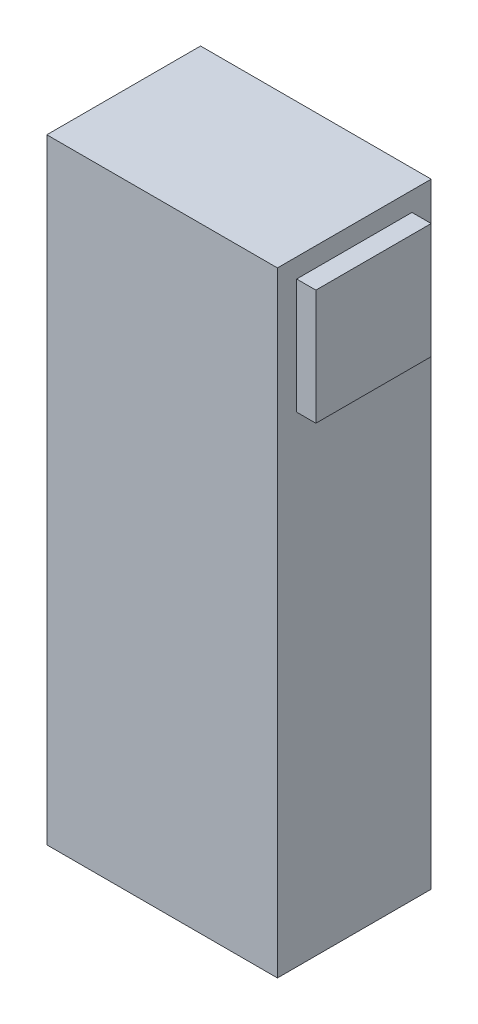
ISO-10303-21;
HEADER;
FILE_DESCRIPTION(('STEP AP214'),'2;1');
FILE_NAME('part.step','',(''),(''),'','','');
FILE_SCHEMA(('AUTOMOTIVE_DESIGN { 1 0 10303 214 1 1 1 1 }'));
ENDSEC;
DATA;
#1=APPLICATION_CONTEXT('core data for automotive mechanical design processes');
#2=APPLICATION_PROTOCOL_DEFINITION('international standard','automotive_design',2000,#1);
#3=PRODUCT_CONTEXT('',#1,'mechanical');
#4=PRODUCT('Part','Part','',(#3));
#5=PRODUCT_RELATED_PRODUCT_CATEGORY('part','',(#4));
#6=PRODUCT_DEFINITION_FORMATION('','',#4);
#7=PRODUCT_DEFINITION_CONTEXT('part definition',#1,'design');
#8=PRODUCT_DEFINITION('design','',#6,#7);
#9=PRODUCT_DEFINITION_SHAPE('','',#8);
#10=(LENGTH_UNIT() NAMED_UNIT(*) SI_UNIT(.MILLI.,.METRE.));
#11=(NAMED_UNIT(*) PLANE_ANGLE_UNIT() SI_UNIT($,.RADIAN.));
#12=(NAMED_UNIT(*) SI_UNIT($,.STERADIAN.) SOLID_ANGLE_UNIT());
#13=UNCERTAINTY_MEASURE_WITH_UNIT(LENGTH_MEASURE(1.E-05),#10,'distance_accuracy_value','');
#14=(GEOMETRIC_REPRESENTATION_CONTEXT(3) GLOBAL_UNCERTAINTY_ASSIGNED_CONTEXT((#13)) GLOBAL_UNIT_ASSIGNED_CONTEXT((#10,
#11,#12)) REPRESENTATION_CONTEXT('',''));
#15=CARTESIAN_POINT('',(0.,0.,0.));
#16=DIRECTION('',(0.,0.,1.));
#17=DIRECTION('',(1.,0.,0.));
#18=AXIS2_PLACEMENT_3D('',#15,#16,#17);
#19=CARTESIAN_POINT('',(0.,101.6,0.));
#20=DIRECTION('',(1.,0.,0.));
#21=DIRECTION('',(0.,0.,-1.));
#22=AXIS2_PLACEMENT_3D('',#19,#20,#21);
#23=PLANE('',#22);
#24=DIRECTION('',(0.,0.,1.));
#25=VECTOR('',#24,1.);
#26=CARTESIAN_POINT('',(0.,0.,0.));
#27=LINE('',#26,#25);
#28=CARTESIAN_POINT('',(0.,0.,-25.4));
#29=VERTEX_POINT('',#28);
#30=CARTESIAN_POINT('',(0.,0.,0.));
#31=VERTEX_POINT('',#30);
#32=EDGE_CURVE('E115',#29,#31,#27,.T.);
#33=ORIENTED_EDGE('',*,*,#32,.T.);
#34=DIRECTION('',(0.,-1.,0.));
#35=VECTOR('',#34,1.);
#36=CARTESIAN_POINT('',(0.,101.6,0.));
#37=LINE('',#36,#35);
#38=CARTESIAN_POINT('',(0.,101.6,0.));
#39=VERTEX_POINT('',#38);
#40=EDGE_CURVE('E11',#39,#31,#37,.T.);
#41=ORIENTED_EDGE('',*,*,#40,.F.);
#42=DIRECTION('',(0.,0.,1.));
#43=VECTOR('',#42,1.);
#44=CARTESIAN_POINT('',(0.,101.6,0.));
#45=LINE('',#44,#43);
#46=CARTESIAN_POINT('',(0.,101.6,-25.4));
#47=VERTEX_POINT('',#46);
#48=EDGE_CURVE('E145',#47,#39,#45,.T.);
#49=ORIENTED_EDGE('',*,*,#48,.F.);
#50=DIRECTION('',(0.,-1.,0.));
#51=VECTOR('',#50,1.);
#52=CARTESIAN_POINT('',(0.,101.6,-25.4));
#53=LINE('',#52,#51);
#54=EDGE_CURVE('E155',#47,#29,#53,.T.);
#55=ORIENTED_EDGE('',*,*,#54,.T.);
#56=EDGE_LOOP('',(#33,#41,#49,#55));
#57=FACE_BOUND('',#56,.T.);
#58=ADVANCED_FACE('F44',(#57),#23,.F.);
#59=CARTESIAN_POINT('',(0.,101.6,0.));
#60=DIRECTION('',(0.,0.,-1.));
#61=DIRECTION('',(-1.,0.,0.));
#62=AXIS2_PLACEMENT_3D('',#59,#60,#61);
#63=PLANE('',#62);
#64=DIRECTION('',(1.,0.,0.));
#65=VECTOR('',#64,1.);
#66=CARTESIAN_POINT('',(0.,0.,0.));
#67=LINE('',#66,#65);
#68=CARTESIAN_POINT('',(38.1,0.,0.));
#69=VERTEX_POINT('',#68);
#70=EDGE_CURVE('E158',#31,#69,#67,.T.);
#71=ORIENTED_EDGE('',*,*,#70,.T.);
#72=DIRECTION('',(0.,-1.,0.));
#73=VECTOR('',#72,1.);
#74=CARTESIAN_POINT('',(38.1,101.6,0.));
#75=LINE('',#74,#73);
#76=CARTESIAN_POINT('',(38.1,101.6,0.));
#77=VERTEX_POINT('',#76);
#78=EDGE_CURVE('E51',#77,#69,#75,.T.);
#79=ORIENTED_EDGE('',*,*,#78,.F.);
#80=DIRECTION('',(1.,0.,0.));
#81=VECTOR('',#80,1.);
#82=CARTESIAN_POINT('',(0.,101.6,0.));
#83=LINE('',#82,#81);
#84=EDGE_CURVE('E148',#39,#77,#83,.T.);
#85=ORIENTED_EDGE('',*,*,#84,.F.);
#86=ORIENTED_EDGE('',*,*,#40,.T.);
#87=EDGE_LOOP('',(#71,#79,#85,#86));
#88=FACE_BOUND('',#87,.T.);
#89=ADVANCED_FACE('F188',(#88),#63,.F.);
#90=CARTESIAN_POINT('',(38.1,101.6,0.));
#91=DIRECTION('',(-1.,0.,0.));
#92=DIRECTION('',(0.,0.,1.));
#93=AXIS2_PLACEMENT_3D('',#90,#91,#92);
#94=PLANE('',#93);
#95=DIRECTION('',(0.,0.,-1.));
#96=VECTOR('',#95,1.);
#97=CARTESIAN_POINT('',(38.1,98.425,0.));
#98=LINE('',#97,#96);
#99=CARTESIAN_POINT('',(38.1,98.425,-3.175));
#100=VERTEX_POINT('',#99);
#101=CARTESIAN_POINT('',(38.1,98.425,-22.225));
#102=VERTEX_POINT('',#101);
#103=EDGE_CURVE('E58',#100,#102,#98,.T.);
#104=ORIENTED_EDGE('',*,*,#103,.T.);
#105=DIRECTION('',(0.,-1.,0.));
#106=VECTOR('',#105,1.);
#107=CARTESIAN_POINT('',(38.1,0.,-22.225));
#108=LINE('',#107,#106);
#109=CARTESIAN_POINT('',(38.1,79.375,-22.225));
#110=VERTEX_POINT('',#109);
#111=EDGE_CURVE('E112',#102,#110,#108,.T.);
#112=ORIENTED_EDGE('',*,*,#111,.T.);
#113=DIRECTION('',(0.,0.,-1.));
#114=VECTOR('',#113,1.);
#115=CARTESIAN_POINT('',(38.1,79.375,0.));
#116=LINE('',#115,#114);
#117=CARTESIAN_POINT('',(38.1,79.375,-3.175));
#118=VERTEX_POINT('',#117);
#119=EDGE_CURVE('E125',#118,#110,#116,.T.);
#120=ORIENTED_EDGE('',*,*,#119,.F.);
#121=DIRECTION('',(0.,-1.,0.));
#122=VECTOR('',#121,1.);
#123=CARTESIAN_POINT('',(38.1,0.,-3.175));
#124=LINE('',#123,#122);
#125=EDGE_CURVE('E63',#100,#118,#124,.T.);
#126=ORIENTED_EDGE('',*,*,#125,.F.);
#127=EDGE_LOOP('',(#104,#112,#120,#126));
#128=FACE_BOUND('',#127,.T.);
#129=DIRECTION('',(0.,0.,-1.));
#130=VECTOR('',#129,1.);
#131=CARTESIAN_POINT('',(38.1,0.,0.));
#132=LINE('',#131,#130);
#133=CARTESIAN_POINT('',(38.1,0.,-25.4));
#134=VERTEX_POINT('',#133);
#135=EDGE_CURVE('E160',#69,#134,#132,.T.);
#136=ORIENTED_EDGE('',*,*,#135,.T.);
#137=DIRECTION('',(0.,-1.,0.));
#138=VECTOR('',#137,1.);
#139=CARTESIAN_POINT('',(38.1,101.6,-25.4));
#140=LINE('',#139,#138);
#141=CARTESIAN_POINT('',(38.1,101.6,-25.4));
#142=VERTEX_POINT('',#141);
#143=EDGE_CURVE('E165',#142,#134,#140,.T.);
#144=ORIENTED_EDGE('',*,*,#143,.F.);
#145=DIRECTION('',(0.,0.,-1.));
#146=VECTOR('',#145,1.);
#147=CARTESIAN_POINT('',(38.1,101.6,0.));
#148=LINE('',#147,#146);
#149=EDGE_CURVE('E151',#77,#142,#148,.T.);
#150=ORIENTED_EDGE('',*,*,#149,.F.);
#151=ORIENTED_EDGE('',*,*,#78,.T.);
#152=EDGE_LOOP('',(#136,#144,#150,#151));
#153=FACE_BOUND('',#152,.T.);
#154=ADVANCED_FACE('F172',(#128,#153),#94,.F.);
#155=CARTESIAN_POINT('',(0.,101.6,-25.4));
#156=DIRECTION('',(0.,0.,1.));
#157=DIRECTION('',(1.,0.,0.));
#158=AXIS2_PLACEMENT_3D('',#155,#156,#157);
#159=PLANE('',#158);
#160=DIRECTION('',(-1.,0.,0.));
#161=VECTOR('',#160,1.);
#162=CARTESIAN_POINT('',(0.,0.,-25.4));
#163=LINE('',#162,#161);
#164=EDGE_CURVE('E149',#134,#29,#163,.T.);
#165=ORIENTED_EDGE('',*,*,#164,.T.);
#166=ORIENTED_EDGE('',*,*,#54,.F.);
#167=DIRECTION('',(-1.,0.,0.));
#168=VECTOR('',#167,1.);
#169=CARTESIAN_POINT('',(0.,101.6,-25.4));
#170=LINE('',#169,#168);
#171=EDGE_CURVE('E153',#142,#47,#170,.T.);
#172=ORIENTED_EDGE('',*,*,#171,.F.);
#173=ORIENTED_EDGE('',*,*,#143,.T.);
#174=EDGE_LOOP('',(#165,#166,#172,#173));
#175=FACE_BOUND('',#174,.T.);
#176=ADVANCED_FACE('F181',(#175),#159,.F.);
#177=CARTESIAN_POINT('',(0.,101.6,0.));
#178=DIRECTION('',(0.,-1.,0.));
#179=DIRECTION('',(0.,0.,-1.));
#180=AXIS2_PLACEMENT_3D('',#177,#178,#179);
#181=PLANE('',#180);
#182=ORIENTED_EDGE('',*,*,#48,.T.);
#183=ORIENTED_EDGE('',*,*,#84,.T.);
#184=ORIENTED_EDGE('',*,*,#149,.T.);
#185=ORIENTED_EDGE('',*,*,#171,.T.);
#186=EDGE_LOOP('',(#182,#183,#184,#185));
#187=FACE_BOUND('',#186,.T.);
#188=ADVANCED_FACE('F187',(#187),#181,.F.);
#189=CARTESIAN_POINT('',(0.,0.,0.));
#190=DIRECTION('',(0.,-1.,0.));
#191=DIRECTION('',(0.,0.,-1.));
#192=AXIS2_PLACEMENT_3D('',#189,#190,#191);
#193=PLANE('',#192);
#194=ORIENTED_EDGE('',*,*,#32,.F.);
#195=ORIENTED_EDGE('',*,*,#164,.F.);
#196=ORIENTED_EDGE('',*,*,#135,.F.);
#197=ORIENTED_EDGE('',*,*,#70,.F.);
#198=EDGE_LOOP('',(#194,#195,#196,#197));
#199=FACE_BOUND('',#198,.T.);
#200=ADVANCED_FACE('F178',(#199),#193,.T.);
#201=CARTESIAN_POINT('',(41.275,0.,-22.225));
#202=DIRECTION('',(0.,0.,-1.));
#203=DIRECTION('',(0.,1.,0.));
#204=AXIS2_PLACEMENT_3D('',#201,#202,#203);
#205=PLANE('',#204);
#206=ORIENTED_EDGE('',*,*,#111,.F.);
#207=DIRECTION('',(-1.,0.,0.));
#208=VECTOR('',#207,1.);
#209=CARTESIAN_POINT('',(41.275,98.425,-22.225));
#210=LINE('',#209,#208);
#211=CARTESIAN_POINT('',(41.275,98.425,-22.225));
#212=VERTEX_POINT('',#211);
#213=EDGE_CURVE('E107',#212,#102,#210,.T.);
#214=ORIENTED_EDGE('',*,*,#213,.F.);
#215=DIRECTION('',(0.,-1.,0.));
#216=VECTOR('',#215,1.);
#217=CARTESIAN_POINT('',(41.275,0.,-22.225));
#218=LINE('',#217,#216);
#219=CARTESIAN_POINT('',(41.275,79.375,-22.225));
#220=VERTEX_POINT('',#219);
#221=EDGE_CURVE('E111',#212,#220,#218,.T.);
#222=ORIENTED_EDGE('',*,*,#221,.T.);
#223=DIRECTION('',(-1.,0.,0.));
#224=VECTOR('',#223,1.);
#225=CARTESIAN_POINT('',(41.275,79.375,-22.225));
#226=LINE('',#225,#224);
#227=EDGE_CURVE('E134',#220,#110,#226,.T.);
#228=ORIENTED_EDGE('',*,*,#227,.T.);
#229=EDGE_LOOP('',(#206,#214,#222,#228));
#230=FACE_BOUND('',#229,.T.);
#231=ADVANCED_FACE('F109',(#230),#205,.T.);
#232=CARTESIAN_POINT('',(41.275,98.425,0.));
#233=DIRECTION('',(0.,1.,0.));
#234=DIRECTION('',(0.,0.,1.));
#235=AXIS2_PLACEMENT_3D('',#232,#233,#234);
#236=PLANE('',#235);
#237=ORIENTED_EDGE('',*,*,#103,.F.);
#238=DIRECTION('',(-1.,0.,0.));
#239=VECTOR('',#238,1.);
#240=CARTESIAN_POINT('',(41.275,98.425,-3.175));
#241=LINE('',#240,#239);
#242=CARTESIAN_POINT('',(41.275,98.425,-3.175));
#243=VERTEX_POINT('',#242);
#244=EDGE_CURVE('E116',#243,#100,#241,.T.);
#245=ORIENTED_EDGE('',*,*,#244,.F.);
#246=DIRECTION('',(0.,0.,-1.));
#247=VECTOR('',#246,1.);
#248=CARTESIAN_POINT('',(41.275,98.425,0.));
#249=LINE('',#248,#247);
#250=EDGE_CURVE('E121',#243,#212,#249,.T.);
#251=ORIENTED_EDGE('',*,*,#250,.T.);
#252=ORIENTED_EDGE('',*,*,#213,.T.);
#253=EDGE_LOOP('',(#237,#245,#251,#252));
#254=FACE_BOUND('',#253,.T.);
#255=ADVANCED_FACE('F127',(#254),#236,.T.);
#256=CARTESIAN_POINT('',(41.275,0.,-3.175));
#257=DIRECTION('',(0.,0.,-1.));
#258=DIRECTION('',(0.,1.,0.));
#259=AXIS2_PLACEMENT_3D('',#256,#257,#258);
#260=PLANE('',#259);
#261=ORIENTED_EDGE('',*,*,#125,.T.);
#262=DIRECTION('',(-1.,0.,0.));
#263=VECTOR('',#262,1.);
#264=CARTESIAN_POINT('',(41.275,79.375,-3.175));
#265=LINE('',#264,#263);
#266=CARTESIAN_POINT('',(41.275,79.375,-3.175));
#267=VERTEX_POINT('',#266);
#268=EDGE_CURVE('E141',#267,#118,#265,.T.);
#269=ORIENTED_EDGE('',*,*,#268,.F.);
#270=DIRECTION('',(0.,-1.,0.));
#271=VECTOR('',#270,1.);
#272=CARTESIAN_POINT('',(41.275,0.,-3.175));
#273=LINE('',#272,#271);
#274=EDGE_CURVE('E129',#243,#267,#273,.T.);
#275=ORIENTED_EDGE('',*,*,#274,.F.);
#276=ORIENTED_EDGE('',*,*,#244,.T.);
#277=EDGE_LOOP('',(#261,#269,#275,#276));
#278=FACE_BOUND('',#277,.T.);
#279=ADVANCED_FACE('F206',(#278),#260,.F.);
#280=CARTESIAN_POINT('',(41.275,79.375,0.));
#281=DIRECTION('',(0.,1.,0.));
#282=DIRECTION('',(0.,0.,1.));
#283=AXIS2_PLACEMENT_3D('',#280,#281,#282);
#284=PLANE('',#283);
#285=ORIENTED_EDGE('',*,*,#119,.T.);
#286=ORIENTED_EDGE('',*,*,#227,.F.);
#287=DIRECTION('',(0.,0.,-1.));
#288=VECTOR('',#287,1.);
#289=CARTESIAN_POINT('',(41.275,79.375,0.));
#290=LINE('',#289,#288);
#291=EDGE_CURVE('E123',#267,#220,#290,.T.);
#292=ORIENTED_EDGE('',*,*,#291,.F.);
#293=ORIENTED_EDGE('',*,*,#268,.T.);
#294=EDGE_LOOP('',(#285,#286,#292,#293));
#295=FACE_BOUND('',#294,.T.);
#296=ADVANCED_FACE('F209',(#295),#284,.F.);
#297=CARTESIAN_POINT('',(41.275,0.,0.));
#298=DIRECTION('',(1.,0.,0.));
#299=DIRECTION('',(0.,0.,-1.));
#300=AXIS2_PLACEMENT_3D('',#297,#298,#299);
#301=PLANE('',#300);
#302=ORIENTED_EDGE('',*,*,#221,.F.);
#303=ORIENTED_EDGE('',*,*,#250,.F.);
#304=ORIENTED_EDGE('',*,*,#274,.T.);
#305=ORIENTED_EDGE('',*,*,#291,.T.);
#306=EDGE_LOOP('',(#302,#303,#304,#305));
#307=FACE_BOUND('',#306,.T.);
#308=ADVANCED_FACE('F120',(#307),#301,.T.);
#309=CLOSED_SHELL('',(#58,#89,#154,#176,#188,#200,#231,#255,#279,#296,#308));
#310=MANIFOLD_SOLID_BREP('B2',#309);
#311=ADVANCED_BREP_SHAPE_REPRESENTATION('',(#18,#310),#14);
#312=SHAPE_DEFINITION_REPRESENTATION(#9,#311);
ENDSEC;
END-ISO-10303-21;
